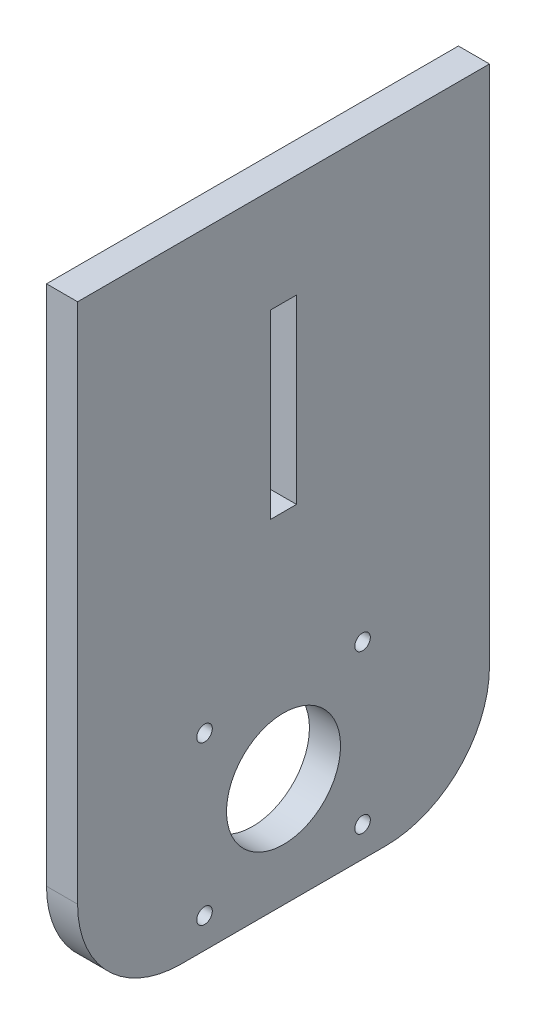
ISO-10303-21;
HEADER;
FILE_DESCRIPTION(('STEP AP214'),'2;1');
FILE_NAME('part.step','',(''),(''),'','','');
FILE_SCHEMA(('AUTOMOTIVE_DESIGN { 1 0 10303 214 1 1 1 1 }'));
ENDSEC;
DATA;
#1=APPLICATION_CONTEXT('core data for automotive mechanical design processes');
#2=APPLICATION_PROTOCOL_DEFINITION('international standard','automotive_design',2000,#1);
#3=PRODUCT_CONTEXT('',#1,'mechanical');
#4=PRODUCT('Part','Part','',(#3));
#5=PRODUCT_RELATED_PRODUCT_CATEGORY('part','',(#4));
#6=PRODUCT_DEFINITION_FORMATION('','',#4);
#7=PRODUCT_DEFINITION_CONTEXT('part definition',#1,'design');
#8=PRODUCT_DEFINITION('design','',#6,#7);
#9=PRODUCT_DEFINITION_SHAPE('','',#8);
#10=(LENGTH_UNIT() NAMED_UNIT(*) SI_UNIT(.MILLI.,.METRE.));
#11=(NAMED_UNIT(*) PLANE_ANGLE_UNIT() SI_UNIT($,.RADIAN.));
#12=(NAMED_UNIT(*) SI_UNIT($,.STERADIAN.) SOLID_ANGLE_UNIT());
#13=UNCERTAINTY_MEASURE_WITH_UNIT(LENGTH_MEASURE(1.E-05),#10,'distance_accuracy_value','');
#14=(GEOMETRIC_REPRESENTATION_CONTEXT(3) GLOBAL_UNCERTAINTY_ASSIGNED_CONTEXT((#13)) GLOBAL_UNIT_ASSIGNED_CONTEXT((#10,
#11,#12)) REPRESENTATION_CONTEXT('',''));
#15=CARTESIAN_POINT('',(0.,0.,0.));
#16=DIRECTION('',(0.,0.,1.));
#17=DIRECTION('',(1.,0.,0.));
#18=AXIS2_PLACEMENT_3D('',#15,#16,#17);
#19=CARTESIAN_POINT('',(6.,0.,0.));
#20=DIRECTION('',(0.,1.,0.));
#21=DIRECTION('',(0.,0.,1.));
#22=AXIS2_PLACEMENT_3D('',#19,#20,#21);
#23=PLANE('',#22);
#24=DIRECTION('',(0.,0.,-1.));
#25=VECTOR('',#24,1.);
#26=CARTESIAN_POINT('',(6.,0.,0.));
#27=LINE('',#26,#25);
#28=CARTESIAN_POINT('',(6.,0.,-20.));
#29=VERTEX_POINT('',#28);
#30=CARTESIAN_POINT('',(6.,0.,-59.5));
#31=VERTEX_POINT('',#30);
#32=EDGE_CURVE('E173',#29,#31,#27,.T.);
#33=ORIENTED_EDGE('',*,*,#32,.F.);
#34=DIRECTION('',(-1.,0.,0.));
#35=VECTOR('',#34,1.);
#36=CARTESIAN_POINT('',(0.,0.,-20.));
#37=LINE('',#36,#35);
#38=CARTESIAN_POINT('',(0.,0.,-20.));
#39=VERTEX_POINT('',#38);
#40=EDGE_CURVE('E218',#29,#39,#37,.T.);
#41=ORIENTED_EDGE('',*,*,#40,.T.);
#42=DIRECTION('',(0.,0.,-1.));
#43=VECTOR('',#42,1.);
#44=CARTESIAN_POINT('',(0.,0.,0.));
#45=LINE('',#44,#43);
#46=CARTESIAN_POINT('',(0.,0.,-59.5));
#47=VERTEX_POINT('',#46);
#48=EDGE_CURVE('E165',#39,#47,#45,.T.);
#49=ORIENTED_EDGE('',*,*,#48,.T.);
#50=DIRECTION('',(-1.,0.,0.));
#51=VECTOR('',#50,1.);
#52=CARTESIAN_POINT('',(6.,0.,-59.5));
#53=LINE('',#52,#51);
#54=EDGE_CURVE('E200',#47,#31,#53,.F.);
#55=ORIENTED_EDGE('',*,*,#54,.T.);
#56=EDGE_LOOP('',(#33,#41,#49,#55));
#57=FACE_BOUND('',#56,.T.);
#58=ADVANCED_FACE('F38',(#57),#23,.F.);
#59=CARTESIAN_POINT('',(6.,0.,-79.5));
#60=DIRECTION('',(0.,0.,1.));
#61=DIRECTION('',(1.,0.,0.));
#62=AXIS2_PLACEMENT_3D('',#59,#60,#61);
#63=PLANE('',#62);
#64=DIRECTION('',(0.,1.,0.));
#65=VECTOR('',#64,1.);
#66=CARTESIAN_POINT('',(6.,43.,-79.5));
#67=LINE('',#66,#65);
#68=CARTESIAN_POINT('',(6.,20.,-79.5));
#69=VERTEX_POINT('',#68);
#70=CARTESIAN_POINT('',(6.,120.7,-79.5));
#71=VERTEX_POINT('',#70);
#72=EDGE_CURVE('E170',#69,#71,#67,.T.);
#73=ORIENTED_EDGE('',*,*,#72,.F.);
#74=DIRECTION('',(-1.,0.,0.));
#75=VECTOR('',#74,1.);
#76=CARTESIAN_POINT('',(6.,20.,-79.5));
#77=LINE('',#76,#75);
#78=CARTESIAN_POINT('',(0.,20.,-79.5));
#79=VERTEX_POINT('',#78);
#80=EDGE_CURVE('E12',#69,#79,#77,.T.);
#81=ORIENTED_EDGE('',*,*,#80,.T.);
#82=DIRECTION('',(0.,1.,0.));
#83=VECTOR('',#82,1.);
#84=CARTESIAN_POINT('',(0.,0.,-79.5));
#85=LINE('',#84,#83);
#86=CARTESIAN_POINT('',(0.,120.7,-79.5));
#87=VERTEX_POINT('',#86);
#88=EDGE_CURVE('E184',#79,#87,#85,.T.);
#89=ORIENTED_EDGE('',*,*,#88,.T.);
#90=DIRECTION('',(-1.,0.,0.));
#91=VECTOR('',#90,1.);
#92=CARTESIAN_POINT('',(6.,120.7,-79.5));
#93=LINE('',#92,#91);
#94=EDGE_CURVE('E188',#71,#87,#93,.T.);
#95=ORIENTED_EDGE('',*,*,#94,.F.);
#96=EDGE_LOOP('',(#73,#81,#89,#95));
#97=FACE_BOUND('',#96,.T.);
#98=ADVANCED_FACE('F247',(#97),#63,.F.);
#99=CARTESIAN_POINT('',(6.,120.7,0.));
#100=DIRECTION('',(0.,1.,0.));
#101=DIRECTION('',(0.,0.,1.));
#102=AXIS2_PLACEMENT_3D('',#99,#100,#101);
#103=PLANE('',#102);
#104=DIRECTION('',(0.,0.,-1.));
#105=VECTOR('',#104,1.);
#106=CARTESIAN_POINT('',(0.,120.7,0.));
#107=LINE('',#106,#105);
#108=CARTESIAN_POINT('',(0.,120.7,0.));
#109=VERTEX_POINT('',#108);
#110=EDGE_CURVE('E180',#109,#87,#107,.T.);
#111=ORIENTED_EDGE('',*,*,#110,.F.);
#112=DIRECTION('',(-1.,0.,0.));
#113=VECTOR('',#112,1.);
#114=CARTESIAN_POINT('',(6.,120.7,0.));
#115=LINE('',#114,#113);
#116=CARTESIAN_POINT('',(6.,120.7,0.));
#117=VERTEX_POINT('',#116);
#118=EDGE_CURVE('E177',#117,#109,#115,.T.);
#119=ORIENTED_EDGE('',*,*,#118,.F.);
#120=DIRECTION('',(0.,0.,-1.));
#121=VECTOR('',#120,1.);
#122=CARTESIAN_POINT('',(6.,120.7,0.));
#123=LINE('',#122,#121);
#124=EDGE_CURVE('E164',#117,#71,#123,.T.);
#125=ORIENTED_EDGE('',*,*,#124,.T.);
#126=ORIENTED_EDGE('',*,*,#94,.T.);
#127=EDGE_LOOP('',(#111,#119,#125,#126));
#128=FACE_BOUND('',#127,.T.);
#129=ADVANCED_FACE('F243',(#128),#103,.T.);
#130=CARTESIAN_POINT('',(6.,43.,0.));
#131=DIRECTION('',(0.,0.,1.));
#132=DIRECTION('',(1.,0.,0.));
#133=AXIS2_PLACEMENT_3D('',#130,#131,#132);
#134=PLANE('',#133);
#135=DIRECTION('',(0.,1.,0.));
#136=VECTOR('',#135,1.);
#137=CARTESIAN_POINT('',(0.,43.,0.));
#138=LINE('',#137,#136);
#139=CARTESIAN_POINT('',(0.,20.,0.));
#140=VERTEX_POINT('',#139);
#141=EDGE_CURVE('E178',#140,#109,#138,.T.);
#142=ORIENTED_EDGE('',*,*,#141,.F.);
#143=DIRECTION('',(-1.,0.,0.));
#144=VECTOR('',#143,1.);
#145=CARTESIAN_POINT('',(6.,20.,0.));
#146=LINE('',#145,#144);
#147=CARTESIAN_POINT('',(6.,20.,0.));
#148=VERTEX_POINT('',#147);
#149=EDGE_CURVE('E61',#140,#148,#146,.F.);
#150=ORIENTED_EDGE('',*,*,#149,.T.);
#151=DIRECTION('',(0.,1.,0.));
#152=VECTOR('',#151,1.);
#153=CARTESIAN_POINT('',(6.,0.,0.));
#154=LINE('',#153,#152);
#155=EDGE_CURVE('E161',#148,#117,#154,.T.);
#156=ORIENTED_EDGE('',*,*,#155,.T.);
#157=ORIENTED_EDGE('',*,*,#118,.T.);
#158=EDGE_LOOP('',(#142,#150,#156,#157));
#159=FACE_BOUND('',#158,.T.);
#160=ADVANCED_FACE('F239',(#159),#134,.T.);
#161=CARTESIAN_POINT('',(6.,0.,0.));
#162=DIRECTION('',(-1.,0.,0.));
#163=DIRECTION('',(0.,0.,1.));
#164=AXIS2_PLACEMENT_3D('',#161,#162,#163);
#165=PLANE('',#164);
#166=CARTESIAN_POINT('',(6.,5.85,-24.5));
#167=DIRECTION('',(1.,0.,0.));
#168=DIRECTION('',(0.,0.,-1.));
#169=AXIS2_PLACEMENT_3D('',#166,#167,#168);
#170=CIRCLE('',#169,1.5);
#171=CARTESIAN_POINT('',(6.,5.85,-26.));
#172=VERTEX_POINT('',#171);
#173=EDGE_CURVE('E336',#172,#172,#170,.T.);
#174=ORIENTED_EDGE('',*,*,#173,.F.);
#175=EDGE_LOOP('',(#174));
#176=FACE_BOUND('',#175,.T.);
#177=CARTESIAN_POINT('',(6.,5.85,-55.));
#178=DIRECTION('',(1.,0.,0.));
#179=DIRECTION('',(0.,0.,-1.));
#180=AXIS2_PLACEMENT_3D('',#177,#178,#179);
#181=CIRCLE('',#180,1.5);
#182=CARTESIAN_POINT('',(6.,5.85,-56.5));
#183=VERTEX_POINT('',#182);
#184=EDGE_CURVE('E324',#183,#183,#181,.T.);
#185=ORIENTED_EDGE('',*,*,#184,.F.);
#186=EDGE_LOOP('',(#185));
#187=FACE_BOUND('',#186,.T.);
#188=CARTESIAN_POINT('',(6.,36.35,-55.));
#189=DIRECTION('',(1.,0.,0.));
#190=DIRECTION('',(0.,0.,-1.));
#191=AXIS2_PLACEMENT_3D('',#188,#189,#190);
#192=CIRCLE('',#191,1.5);
#193=CARTESIAN_POINT('',(6.,36.35,-56.5));
#194=VERTEX_POINT('',#193);
#195=EDGE_CURVE('E317',#194,#194,#192,.T.);
#196=ORIENTED_EDGE('',*,*,#195,.F.);
#197=EDGE_LOOP('',(#196));
#198=FACE_BOUND('',#197,.T.);
#199=CARTESIAN_POINT('',(6.,36.35,-24.5));
#200=DIRECTION('',(1.,0.,0.));
#201=DIRECTION('',(0.,0.,-1.));
#202=AXIS2_PLACEMENT_3D('',#199,#200,#201);
#203=CIRCLE('',#202,1.5);
#204=CARTESIAN_POINT('',(6.,36.35,-26.));
#205=VERTEX_POINT('',#204);
#206=EDGE_CURVE('E314',#205,#205,#203,.T.);
#207=ORIENTED_EDGE('',*,*,#206,.F.);
#208=EDGE_LOOP('',(#207));
#209=FACE_BOUND('',#208,.T.);
#210=CARTESIAN_POINT('',(6.,21.1,-39.75));
#211=DIRECTION('',(1.,0.,0.));
#212=DIRECTION('',(0.,0.,-1.));
#213=AXIS2_PLACEMENT_3D('',#210,#211,#212);
#214=CIRCLE('',#213,11.);
#215=CARTESIAN_POINT('',(6.,21.1,-50.75));
#216=VERTEX_POINT('',#215);
#217=EDGE_CURVE('E205',#216,#216,#214,.T.);
#218=ORIENTED_EDGE('',*,*,#217,.F.);
#219=EDGE_LOOP('',(#218));
#220=FACE_BOUND('',#219,.T.);
#221=DIRECTION('',(0.,0.,-1.));
#222=VECTOR('',#221,1.);
#223=CARTESIAN_POINT('',(6.,65.7,-37.25));
#224=LINE('',#223,#222);
#225=CARTESIAN_POINT('',(6.,65.7,-37.25));
#226=VERTEX_POINT('',#225);
#227=CARTESIAN_POINT('',(6.,65.7,-42.25));
#228=VERTEX_POINT('',#227);
#229=EDGE_CURVE('E133',#226,#228,#224,.T.);
#230=ORIENTED_EDGE('',*,*,#229,.F.);
#231=DIRECTION('',(0.,-1.,0.));
#232=VECTOR('',#231,1.);
#233=CARTESIAN_POINT('',(6.,100.7,-37.25));
#234=LINE('',#233,#232);
#235=CARTESIAN_POINT('',(6.,100.7,-37.25));
#236=VERTEX_POINT('',#235);
#237=EDGE_CURVE('E139',#236,#226,#234,.T.);
#238=ORIENTED_EDGE('',*,*,#237,.F.);
#239=DIRECTION('',(0.,0.,1.));
#240=VECTOR('',#239,1.);
#241=CARTESIAN_POINT('',(6.,100.7,-37.25));
#242=LINE('',#241,#240);
#243=CARTESIAN_POINT('',(6.,100.7,-42.25));
#244=VERTEX_POINT('',#243);
#245=EDGE_CURVE('E143',#244,#236,#242,.T.);
#246=ORIENTED_EDGE('',*,*,#245,.F.);
#247=DIRECTION('',(0.,1.,0.));
#248=VECTOR('',#247,1.);
#249=CARTESIAN_POINT('',(6.,100.7,-42.25));
#250=LINE('',#249,#248);
#251=EDGE_CURVE('E122',#228,#244,#250,.T.);
#252=ORIENTED_EDGE('',*,*,#251,.F.);
#253=EDGE_LOOP('',(#230,#238,#246,#252));
#254=FACE_BOUND('',#253,.T.);
#255=ORIENTED_EDGE('',*,*,#155,.F.);
#256=CARTESIAN_POINT('',(6.,20.,-20.));
#257=DIRECTION('',(-1.,0.,0.));
#258=DIRECTION('',(0.,0.,1.));
#259=AXIS2_PLACEMENT_3D('',#256,#257,#258);
#260=CIRCLE('',#259,20.);
#261=EDGE_CURVE('E46',#148,#29,#260,.F.);
#262=ORIENTED_EDGE('',*,*,#261,.T.);
#263=ORIENTED_EDGE('',*,*,#32,.T.);
#264=CARTESIAN_POINT('',(6.,20.,-59.5));
#265=DIRECTION('',(-1.,0.,0.));
#266=DIRECTION('',(0.,0.,1.));
#267=AXIS2_PLACEMENT_3D('',#264,#265,#266);
#268=CIRCLE('',#267,20.);
#269=EDGE_CURVE('E53',#31,#69,#268,.F.);
#270=ORIENTED_EDGE('',*,*,#269,.T.);
#271=ORIENTED_EDGE('',*,*,#72,.T.);
#272=ORIENTED_EDGE('',*,*,#124,.F.);
#273=EDGE_LOOP('',(#255,#262,#263,#270,#271,#272));
#274=FACE_BOUND('',#273,.T.);
#275=ADVANCED_FACE('F141',(#176,#187,#198,#209,#220,#254,#274),#165,.F.);
#276=CARTESIAN_POINT('',(0.,0.,0.));
#277=DIRECTION('',(-1.,0.,0.));
#278=DIRECTION('',(0.,0.,1.));
#279=AXIS2_PLACEMENT_3D('',#276,#277,#278);
#280=PLANE('',#279);
#281=CARTESIAN_POINT('',(0.,5.85,-24.5));
#282=DIRECTION('',(-1.,0.,0.));
#283=DIRECTION('',(0.,0.,1.));
#284=AXIS2_PLACEMENT_3D('',#281,#282,#283);
#285=CIRCLE('',#284,1.5);
#286=CARTESIAN_POINT('',(0.,5.85,-23.));
#287=VERTEX_POINT('',#286);
#288=EDGE_CURVE('E214',#287,#287,#285,.T.);
#289=ORIENTED_EDGE('',*,*,#288,.F.);
#290=EDGE_LOOP('',(#289));
#291=FACE_BOUND('',#290,.T.);
#292=CARTESIAN_POINT('',(0.,5.85,-55.));
#293=DIRECTION('',(-1.,0.,0.));
#294=DIRECTION('',(0.,0.,1.));
#295=AXIS2_PLACEMENT_3D('',#292,#293,#294);
#296=CIRCLE('',#295,1.5);
#297=CARTESIAN_POINT('',(0.,5.85,-53.5));
#298=VERTEX_POINT('',#297);
#299=EDGE_CURVE('E211',#298,#298,#296,.T.);
#300=ORIENTED_EDGE('',*,*,#299,.F.);
#301=EDGE_LOOP('',(#300));
#302=FACE_BOUND('',#301,.T.);
#303=CARTESIAN_POINT('',(0.,36.35,-55.));
#304=DIRECTION('',(-1.,0.,0.));
#305=DIRECTION('',(0.,0.,1.));
#306=AXIS2_PLACEMENT_3D('',#303,#304,#305);
#307=CIRCLE('',#306,1.5);
#308=CARTESIAN_POINT('',(0.,36.35,-53.5));
#309=VERTEX_POINT('',#308);
#310=EDGE_CURVE('E208',#309,#309,#307,.T.);
#311=ORIENTED_EDGE('',*,*,#310,.F.);
#312=EDGE_LOOP('',(#311));
#313=FACE_BOUND('',#312,.T.);
#314=CARTESIAN_POINT('',(0.,36.35,-24.5));
#315=DIRECTION('',(-1.,0.,0.));
#316=DIRECTION('',(0.,0.,1.));
#317=AXIS2_PLACEMENT_3D('',#314,#315,#316);
#318=CIRCLE('',#317,1.5);
#319=CARTESIAN_POINT('',(0.,36.35,-23.));
#320=VERTEX_POINT('',#319);
#321=EDGE_CURVE('E204',#320,#320,#318,.T.);
#322=ORIENTED_EDGE('',*,*,#321,.F.);
#323=EDGE_LOOP('',(#322));
#324=FACE_BOUND('',#323,.T.);
#325=CARTESIAN_POINT('',(0.,21.1,-39.75));
#326=DIRECTION('',(-1.,0.,0.));
#327=DIRECTION('',(0.,0.,1.));
#328=AXIS2_PLACEMENT_3D('',#325,#326,#327);
#329=CIRCLE('',#328,11.);
#330=CARTESIAN_POINT('',(0.,21.1,-28.75));
#331=VERTEX_POINT('',#330);
#332=EDGE_CURVE('E201',#331,#331,#329,.T.);
#333=ORIENTED_EDGE('',*,*,#332,.F.);
#334=EDGE_LOOP('',(#333));
#335=FACE_BOUND('',#334,.T.);
#336=DIRECTION('',(0.,1.,0.));
#337=VECTOR('',#336,1.);
#338=CARTESIAN_POINT('',(0.,0.,-37.25));
#339=LINE('',#338,#337);
#340=CARTESIAN_POINT('',(0.,65.7,-37.25));
#341=VERTEX_POINT('',#340);
#342=CARTESIAN_POINT('',(0.,100.7,-37.25));
#343=VERTEX_POINT('',#342);
#344=EDGE_CURVE('E198',#341,#343,#339,.T.);
#345=ORIENTED_EDGE('',*,*,#344,.F.);
#346=DIRECTION('',(0.,0.,1.));
#347=VECTOR('',#346,1.);
#348=CARTESIAN_POINT('',(0.,65.7,0.));
#349=LINE('',#348,#347);
#350=CARTESIAN_POINT('',(0.,65.7,-42.25));
#351=VERTEX_POINT('',#350);
#352=EDGE_CURVE('E191',#351,#341,#349,.T.);
#353=ORIENTED_EDGE('',*,*,#352,.F.);
#354=DIRECTION('',(0.,-1.,0.));
#355=VECTOR('',#354,1.);
#356=CARTESIAN_POINT('',(0.,0.,-42.25));
#357=LINE('',#356,#355);
#358=CARTESIAN_POINT('',(0.,100.7,-42.25));
#359=VERTEX_POINT('',#358);
#360=EDGE_CURVE('E125',#359,#351,#357,.T.);
#361=ORIENTED_EDGE('',*,*,#360,.F.);
#362=DIRECTION('',(0.,0.,-1.));
#363=VECTOR('',#362,1.);
#364=CARTESIAN_POINT('',(0.,100.7,0.));
#365=LINE('',#364,#363);
#366=EDGE_CURVE('E196',#343,#359,#365,.T.);
#367=ORIENTED_EDGE('',*,*,#366,.F.);
#368=EDGE_LOOP('',(#345,#353,#361,#367));
#369=FACE_BOUND('',#368,.T.);
#370=ORIENTED_EDGE('',*,*,#48,.F.);
#371=CARTESIAN_POINT('',(0.,20.,-20.));
#372=DIRECTION('',(-1.,0.,0.));
#373=DIRECTION('',(0.,0.,1.));
#374=AXIS2_PLACEMENT_3D('',#371,#372,#373);
#375=CIRCLE('',#374,20.);
#376=EDGE_CURVE('E223',#39,#140,#375,.T.);
#377=ORIENTED_EDGE('',*,*,#376,.T.);
#378=ORIENTED_EDGE('',*,*,#141,.T.);
#379=ORIENTED_EDGE('',*,*,#110,.T.);
#380=ORIENTED_EDGE('',*,*,#88,.F.);
#381=CARTESIAN_POINT('',(0.,20.,-59.5));
#382=DIRECTION('',(-1.,0.,0.));
#383=DIRECTION('',(0.,0.,1.));
#384=AXIS2_PLACEMENT_3D('',#381,#382,#383);
#385=CIRCLE('',#384,20.);
#386=EDGE_CURVE('E221',#79,#47,#385,.T.);
#387=ORIENTED_EDGE('',*,*,#386,.T.);
#388=EDGE_LOOP('',(#370,#377,#378,#379,#380,#387));
#389=FACE_BOUND('',#388,.T.);
#390=ADVANCED_FACE('F238',(#291,#302,#313,#324,#335,#369,#389),#280,.T.);
#391=CARTESIAN_POINT('',(-4.,100.7,-37.25));
#392=DIRECTION('',(0.,0.,1.));
#393=DIRECTION('',(1.,0.,0.));
#394=AXIS2_PLACEMENT_3D('',#391,#392,#393);
#395=PLANE('',#394);
#396=ORIENTED_EDGE('',*,*,#344,.T.);
#397=DIRECTION('',(1.,0.,0.));
#398=VECTOR('',#397,1.);
#399=CARTESIAN_POINT('',(-4.,100.7,-37.25));
#400=LINE('',#399,#398);
#401=EDGE_CURVE('E181',#343,#236,#400,.T.);
#402=ORIENTED_EDGE('',*,*,#401,.T.);
#403=ORIENTED_EDGE('',*,*,#237,.T.);
#404=DIRECTION('',(1.,0.,0.));
#405=VECTOR('',#404,1.);
#406=CARTESIAN_POINT('',(-4.,65.7,-37.25));
#407=LINE('',#406,#405);
#408=EDGE_CURVE('E129',#341,#226,#407,.T.);
#409=ORIENTED_EDGE('',*,*,#408,.F.);
#410=EDGE_LOOP('',(#396,#402,#403,#409));
#411=FACE_BOUND('',#410,.T.);
#412=ADVANCED_FACE('F274',(#411),#395,.F.);
#413=CARTESIAN_POINT('',(-4.,100.7,-37.25));
#414=DIRECTION('',(0.,1.,0.));
#415=DIRECTION('',(0.,0.,1.));
#416=AXIS2_PLACEMENT_3D('',#413,#414,#415);
#417=PLANE('',#416);
#418=ORIENTED_EDGE('',*,*,#366,.T.);
#419=DIRECTION('',(1.,0.,0.));
#420=VECTOR('',#419,1.);
#421=CARTESIAN_POINT('',(-4.,100.7,-42.25));
#422=LINE('',#421,#420);
#423=EDGE_CURVE('E128',#359,#244,#422,.T.);
#424=ORIENTED_EDGE('',*,*,#423,.T.);
#425=ORIENTED_EDGE('',*,*,#245,.T.);
#426=ORIENTED_EDGE('',*,*,#401,.F.);
#427=EDGE_LOOP('',(#418,#424,#425,#426));
#428=FACE_BOUND('',#427,.T.);
#429=ADVANCED_FACE('F281',(#428),#417,.F.);
#430=CARTESIAN_POINT('',(-4.,100.7,-42.25));
#431=DIRECTION('',(0.,0.,-1.));
#432=DIRECTION('',(0.,1.,0.));
#433=AXIS2_PLACEMENT_3D('',#430,#431,#432);
#434=PLANE('',#433);
#435=ORIENTED_EDGE('',*,*,#360,.T.);
#436=DIRECTION('',(1.,0.,0.));
#437=VECTOR('',#436,1.);
#438=CARTESIAN_POINT('',(-4.,65.7,-42.25));
#439=LINE('',#438,#437);
#440=EDGE_CURVE('E117',#351,#228,#439,.T.);
#441=ORIENTED_EDGE('',*,*,#440,.T.);
#442=ORIENTED_EDGE('',*,*,#251,.T.);
#443=ORIENTED_EDGE('',*,*,#423,.F.);
#444=EDGE_LOOP('',(#435,#441,#442,#443));
#445=FACE_BOUND('',#444,.T.);
#446=ADVANCED_FACE('F119',(#445),#434,.F.);
#447=CARTESIAN_POINT('',(-4.,65.7,-37.25));
#448=DIRECTION('',(0.,-1.,0.));
#449=DIRECTION('',(0.,0.,-1.));
#450=AXIS2_PLACEMENT_3D('',#447,#448,#449);
#451=PLANE('',#450);
#452=ORIENTED_EDGE('',*,*,#352,.T.);
#453=ORIENTED_EDGE('',*,*,#408,.T.);
#454=ORIENTED_EDGE('',*,*,#229,.T.);
#455=ORIENTED_EDGE('',*,*,#440,.F.);
#456=EDGE_LOOP('',(#452,#453,#454,#455));
#457=FACE_BOUND('',#456,.T.);
#458=ADVANCED_FACE('F134',(#457),#451,.F.);
#459=CARTESIAN_POINT('',(-4.,21.1,-39.75));
#460=DIRECTION('',(1.,0.,0.));
#461=DIRECTION('',(0.,0.,-1.));
#462=AXIS2_PLACEMENT_3D('',#459,#460,#461);
#463=CYLINDRICAL_SURFACE('',#462,11.);
#464=ORIENTED_EDGE('',*,*,#332,.T.);
#465=EDGE_LOOP('',(#464));
#466=FACE_BOUND('',#465,.T.);
#467=ORIENTED_EDGE('',*,*,#217,.T.);
#468=EDGE_LOOP('',(#467));
#469=FACE_BOUND('',#468,.T.);
#470=ADVANCED_FACE('F285',(#466,#469),#463,.F.);
#471=CARTESIAN_POINT('',(-4.,36.35,-24.5));
#472=DIRECTION('',(1.,0.,0.));
#473=DIRECTION('',(0.,0.,-1.));
#474=AXIS2_PLACEMENT_3D('',#471,#472,#473);
#475=CYLINDRICAL_SURFACE('',#474,1.5);
#476=ORIENTED_EDGE('',*,*,#321,.T.);
#477=EDGE_LOOP('',(#476));
#478=FACE_BOUND('',#477,.T.);
#479=ORIENTED_EDGE('',*,*,#206,.T.);
#480=EDGE_LOOP('',(#479));
#481=FACE_BOUND('',#480,.T.);
#482=ADVANCED_FACE('F293',(#478,#481),#475,.F.);
#483=CARTESIAN_POINT('',(-4.,36.35,-55.));
#484=DIRECTION('',(1.,0.,0.));
#485=DIRECTION('',(0.,0.,-1.));
#486=AXIS2_PLACEMENT_3D('',#483,#484,#485);
#487=CYLINDRICAL_SURFACE('',#486,1.5);
#488=ORIENTED_EDGE('',*,*,#310,.T.);
#489=EDGE_LOOP('',(#488));
#490=FACE_BOUND('',#489,.T.);
#491=ORIENTED_EDGE('',*,*,#195,.T.);
#492=EDGE_LOOP('',(#491));
#493=FACE_BOUND('',#492,.T.);
#494=ADVANCED_FACE('F301',(#490,#493),#487,.F.);
#495=CARTESIAN_POINT('',(-4.,5.85,-55.));
#496=DIRECTION('',(1.,0.,0.));
#497=DIRECTION('',(0.,0.,-1.));
#498=AXIS2_PLACEMENT_3D('',#495,#496,#497);
#499=CYLINDRICAL_SURFACE('',#498,1.5);
#500=ORIENTED_EDGE('',*,*,#299,.T.);
#501=EDGE_LOOP('',(#500));
#502=FACE_BOUND('',#501,.T.);
#503=ORIENTED_EDGE('',*,*,#184,.T.);
#504=EDGE_LOOP('',(#503));
#505=FACE_BOUND('',#504,.T.);
#506=ADVANCED_FACE('F297',(#502,#505),#499,.F.);
#507=CARTESIAN_POINT('',(-4.,5.85,-24.5));
#508=DIRECTION('',(1.,0.,0.));
#509=DIRECTION('',(0.,0.,-1.));
#510=AXIS2_PLACEMENT_3D('',#507,#508,#509);
#511=CYLINDRICAL_SURFACE('',#510,1.5);
#512=ORIENTED_EDGE('',*,*,#288,.T.);
#513=EDGE_LOOP('',(#512));
#514=FACE_BOUND('',#513,.T.);
#515=ORIENTED_EDGE('',*,*,#173,.T.);
#516=EDGE_LOOP('',(#515));
#517=FACE_BOUND('',#516,.T.);
#518=ADVANCED_FACE('F254',(#514,#517),#511,.F.);
#519=CARTESIAN_POINT('',(6.,20.,-20.));
#520=DIRECTION('',(1.,0.,0.));
#521=DIRECTION('',(0.,0.,-1.));
#522=AXIS2_PLACEMENT_3D('',#519,#520,#521);
#523=CYLINDRICAL_SURFACE('',#522,20.);
#524=ORIENTED_EDGE('',*,*,#261,.F.);
#525=ORIENTED_EDGE('',*,*,#149,.F.);
#526=ORIENTED_EDGE('',*,*,#376,.F.);
#527=ORIENTED_EDGE('',*,*,#40,.F.);
#528=EDGE_LOOP('',(#524,#525,#526,#527));
#529=FACE_BOUND('',#528,.T.);
#530=ADVANCED_FACE('F236',(#529),#523,.T.);
#531=CARTESIAN_POINT('',(6.,20.,-59.5));
#532=DIRECTION('',(-1.,0.,0.));
#533=DIRECTION('',(0.,0.,1.));
#534=AXIS2_PLACEMENT_3D('',#531,#532,#533);
#535=CYLINDRICAL_SURFACE('',#534,20.);
#536=ORIENTED_EDGE('',*,*,#269,.F.);
#537=ORIENTED_EDGE('',*,*,#54,.F.);
#538=ORIENTED_EDGE('',*,*,#386,.F.);
#539=ORIENTED_EDGE('',*,*,#80,.F.);
#540=EDGE_LOOP('',(#536,#537,#538,#539));
#541=FACE_BOUND('',#540,.T.);
#542=ADVANCED_FACE('F40',(#541),#535,.T.);
#543=CLOSED_SHELL('',(#58,#98,#129,#160,#275,#390,#412,#429,#446,#458,#470,#482,#494,#506,#518,
#530,#542));
#544=MANIFOLD_SOLID_BREP('B2',#543);
#545=ADVANCED_BREP_SHAPE_REPRESENTATION('',(#18,#544),#14);
#546=SHAPE_DEFINITION_REPRESENTATION(#9,#545);
ENDSEC;
END-ISO-10303-21;
